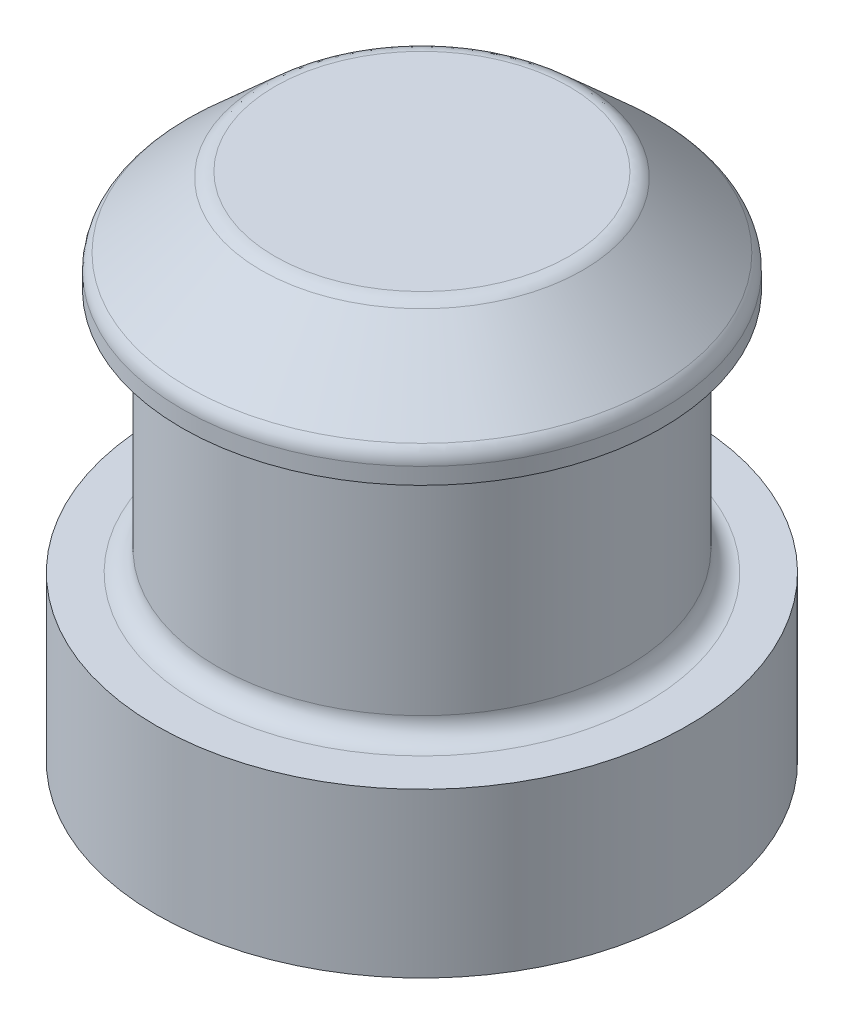
ISO-10303-21;
HEADER;
FILE_DESCRIPTION(('STEP AP214'),'2;1');
FILE_NAME('part.step','',(''),(''),'','','');
FILE_SCHEMA(('AUTOMOTIVE_DESIGN { 1 0 10303 214 1 1 1 1 }'));
ENDSEC;
DATA;
#1=APPLICATION_CONTEXT('core data for automotive mechanical design processes');
#2=APPLICATION_PROTOCOL_DEFINITION('international standard','automotive_design',2000,#1);
#3=PRODUCT_CONTEXT('',#1,'mechanical');
#4=PRODUCT('Part','Part','',(#3));
#5=PRODUCT_RELATED_PRODUCT_CATEGORY('part','',(#4));
#6=PRODUCT_DEFINITION_FORMATION('','',#4);
#7=PRODUCT_DEFINITION_CONTEXT('part definition',#1,'design');
#8=PRODUCT_DEFINITION('design','',#6,#7);
#9=PRODUCT_DEFINITION_SHAPE('','',#8);
#10=(LENGTH_UNIT() NAMED_UNIT(*) SI_UNIT(.MILLI.,.METRE.));
#11=(NAMED_UNIT(*) PLANE_ANGLE_UNIT() SI_UNIT($,.RADIAN.));
#12=(NAMED_UNIT(*) SI_UNIT($,.STERADIAN.) SOLID_ANGLE_UNIT());
#13=UNCERTAINTY_MEASURE_WITH_UNIT(LENGTH_MEASURE(1.E-05),#10,'distance_accuracy_value','');
#14=(GEOMETRIC_REPRESENTATION_CONTEXT(3) GLOBAL_UNCERTAINTY_ASSIGNED_CONTEXT((#13)) GLOBAL_UNIT_ASSIGNED_CONTEXT((#10,
#11,#12)) REPRESENTATION_CONTEXT('',''));
#15=CARTESIAN_POINT('',(0.,0.,0.));
#16=DIRECTION('',(0.,0.,1.));
#17=DIRECTION('',(1.,0.,0.));
#18=AXIS2_PLACEMENT_3D('',#15,#16,#17);
#19=CARTESIAN_POINT('',(0.,1.51003988104463,0.));
#20=DIRECTION('',(0.,-1.,0.));
#21=DIRECTION('',(0.,0.,-1.));
#22=AXIS2_PLACEMENT_3D('',#19,#20,#21);
#23=CYLINDRICAL_SURFACE('',#22,2.99);
#24=CARTESIAN_POINT('',(0.,1.51003988104463,0.));
#25=DIRECTION('',(0.,1.,0.));
#26=DIRECTION('',(0.,0.,1.));
#27=AXIS2_PLACEMENT_3D('',#24,#25,#26);
#28=CIRCLE('',#27,2.99);
#29=CARTESIAN_POINT('',(0.,1.51003988104463,2.99));
#30=VERTEX_POINT('',#29);
#31=EDGE_CURVE('E69',#30,#30,#28,.T.);
#32=ORIENTED_EDGE('',*,*,#31,.F.);
#33=EDGE_LOOP('',(#32));
#34=FACE_BOUND('',#33,.T.);
#35=CARTESIAN_POINT('',(0.,-0.329960118955374,0.));
#36=DIRECTION('',(0.,1.,0.));
#37=DIRECTION('',(0.,0.,1.));
#38=AXIS2_PLACEMENT_3D('',#35,#36,#37);
#39=CIRCLE('',#38,2.99);
#40=CARTESIAN_POINT('',(0.,-0.329960118955374,2.99));
#41=VERTEX_POINT('',#40);
#42=EDGE_CURVE('E70',#41,#41,#39,.T.);
#43=ORIENTED_EDGE('',*,*,#42,.T.);
#44=EDGE_LOOP('',(#43));
#45=FACE_BOUND('',#44,.T.);
#46=ADVANCED_FACE('F37',(#34,#45),#23,.T.);
#47=CARTESIAN_POINT('',(0.,1.51003988104463,0.));
#48=DIRECTION('',(0.,1.,0.));
#49=DIRECTION('',(0.,0.,1.));
#50=AXIS2_PLACEMENT_3D('',#47,#48,#49);
#51=PLANE('',#50);
#52=CARTESIAN_POINT('',(0.,1.51003988104463,0.));
#53=DIRECTION('',(0.,1.,0.));
#54=DIRECTION('',(0.,0.,1.));
#55=AXIS2_PLACEMENT_3D('',#52,#53,#54);
#56=CIRCLE('',#55,2.53);
#57=CARTESIAN_POINT('',(0.,1.51003988104463,2.53));
#58=VERTEX_POINT('',#57);
#59=EDGE_CURVE('E10',#58,#58,#56,.F.);
#60=ORIENTED_EDGE('',*,*,#59,.T.);
#61=EDGE_LOOP('',(#60));
#62=FACE_BOUND('',#61,.T.);
#63=ORIENTED_EDGE('',*,*,#31,.T.);
#64=EDGE_LOOP('',(#63));
#65=FACE_BOUND('',#64,.T.);
#66=ADVANCED_FACE('F105',(#62,#65),#51,.T.);
#67=CARTESIAN_POINT('',(0.,-0.329960118955374,0.));
#68=DIRECTION('',(0.,1.,0.));
#69=DIRECTION('',(0.,0.,1.));
#70=AXIS2_PLACEMENT_3D('',#67,#68,#69);
#71=PLANE('',#70);
#72=ORIENTED_EDGE('',*,*,#42,.F.);
#73=EDGE_LOOP('',(#72));
#74=FACE_BOUND('',#73,.T.);
#75=ADVANCED_FACE('F111',(#74),#71,.F.);
#76=CARTESIAN_POINT('',(0.,4.27003988104463,0.));
#77=DIRECTION('',(0.,-1.,0.));
#78=DIRECTION('',(0.,0.,-1.));
#79=AXIS2_PLACEMENT_3D('',#76,#77,#78);
#80=CYLINDRICAL_SURFACE('',#79,2.3);
#81=CARTESIAN_POINT('',(0.,1.74003988104463,0.));
#82=DIRECTION('',(0.,1.,0.));
#83=DIRECTION('',(0.,0.,1.));
#84=AXIS2_PLACEMENT_3D('',#81,#82,#83);
#85=CIRCLE('',#84,2.3);
#86=CARTESIAN_POINT('',(0.,1.74003988104463,2.3));
#87=VERTEX_POINT('',#86);
#88=EDGE_CURVE('E45',#87,#87,#85,.T.);
#89=ORIENTED_EDGE('',*,*,#88,.T.);
#90=EDGE_LOOP('',(#89));
#91=FACE_BOUND('',#90,.T.);
#92=CARTESIAN_POINT('',(0.,4.27003988104463,0.));
#93=DIRECTION('',(0.,1.,0.));
#94=DIRECTION('',(0.,0.,1.));
#95=AXIS2_PLACEMENT_3D('',#92,#93,#94);
#96=CIRCLE('',#95,2.3);
#97=CARTESIAN_POINT('',(0.,4.27003988104463,2.3));
#98=VERTEX_POINT('',#97);
#99=EDGE_CURVE('E74',#98,#98,#96,.T.);
#100=ORIENTED_EDGE('',*,*,#99,.F.);
#101=EDGE_LOOP('',(#100));
#102=FACE_BOUND('',#101,.T.);
#103=ADVANCED_FACE('F131',(#91,#102),#80,.T.);
#104=CARTESIAN_POINT('',(0.,5.42003988104463,0.));
#105=DIRECTION('',(0.,-1.,0.));
#106=DIRECTION('',(0.,0.,-1.));
#107=AXIS2_PLACEMENT_3D('',#104,#105,#106);
#108=CYLINDRICAL_SURFACE('',#107,2.7025);
#109=CARTESIAN_POINT('',(0.,4.45513728342366,0.));
#110=DIRECTION('',(0.,1.,0.));
#111=DIRECTION('',(0.,0.,1.));
#112=AXIS2_PLACEMENT_3D('',#109,#110,#111);
#113=CIRCLE('',#112,2.7025);
#114=CARTESIAN_POINT('',(0.,4.45513728342366,2.7025));
#115=VERTEX_POINT('',#114);
#116=EDGE_CURVE('E50',#115,#115,#113,.F.);
#117=ORIENTED_EDGE('',*,*,#116,.T.);
#118=EDGE_LOOP('',(#117));
#119=FACE_BOUND('',#118,.T.);
#120=CARTESIAN_POINT('',(0.,4.27003988104463,0.));
#121=DIRECTION('',(0.,1.,0.));
#122=DIRECTION('',(0.,0.,1.));
#123=AXIS2_PLACEMENT_3D('',#120,#121,#122);
#124=CIRCLE('',#123,2.7025);
#125=CARTESIAN_POINT('',(0.,4.27003988104463,2.7025));
#126=VERTEX_POINT('',#125);
#127=EDGE_CURVE('E81',#126,#126,#124,.T.);
#128=ORIENTED_EDGE('',*,*,#127,.T.);
#129=EDGE_LOOP('',(#128));
#130=FACE_BOUND('',#129,.T.);
#131=ADVANCED_FACE('F86',(#119,#130),#108,.T.);
#132=CARTESIAN_POINT('',(0.,5.42003988104463,0.));
#133=DIRECTION('',(0.,1.,0.));
#134=DIRECTION('',(0.,0.,1.));
#135=AXIS2_PLACEMENT_3D('',#132,#133,#134);
#136=PLANE('',#135);
#137=CARTESIAN_POINT('',(0.,5.42003988104463,0.));
#138=DIRECTION('',(0.,1.,0.));
#139=DIRECTION('',(0.,0.,1.));
#140=AXIS2_PLACEMENT_3D('',#137,#138,#139);
#141=CIRCLE('',#140,1.65630797790167);
#142=CARTESIAN_POINT('',(0.,5.42003988104463,1.65630797790167));
#143=VERTEX_POINT('',#142);
#144=EDGE_CURVE('E65',#143,#143,#141,.T.);
#145=ORIENTED_EDGE('',*,*,#144,.T.);
#146=EDGE_LOOP('',(#145));
#147=FACE_BOUND('',#146,.T.);
#148=ADVANCED_FACE('F91',(#147),#136,.T.);
#149=CARTESIAN_POINT('',(0.,4.27003988104463,0.));
#150=DIRECTION('',(0.,1.,0.));
#151=DIRECTION('',(0.,0.,1.));
#152=AXIS2_PLACEMENT_3D('',#149,#150,#151);
#153=PLANE('',#152);
#154=ORIENTED_EDGE('',*,*,#99,.T.);
#155=EDGE_LOOP('',(#154));
#156=FACE_BOUND('',#155,.T.);
#157=ORIENTED_EDGE('',*,*,#127,.F.);
#158=EDGE_LOOP('',(#157));
#159=FACE_BOUND('',#158,.T.);
#160=ADVANCED_FACE('F88',(#156,#159),#153,.F.);
#161=CARTESIAN_POINT('',(0.,5.42003988104463,0.));
#162=DIRECTION('',(0.,-1.,0.));
#163=DIRECTION('',(0.,0.,-1.));
#164=AXIS2_PLACEMENT_3D('',#161,#162,#163);
#165=CONICAL_SURFACE('',#164,1.74459670595982,0.837758040957277);
#166=CARTESIAN_POINT('',(0.,5.36096319090443,0.));
#167=DIRECTION('',(0.,1.,0.));
#168=DIRECTION('',(0.,0.,1.));
#169=AXIS2_PLACEMENT_3D('',#166,#167,#168);
#170=CIRCLE('',#169,1.81020801736421);
#171=CARTESIAN_POINT('',(0.,5.36096319090443,1.81020801736421));
#172=VERTEX_POINT('',#171);
#173=EDGE_CURVE('E55',#172,#172,#170,.F.);
#174=ORIENTED_EDGE('',*,*,#173,.T.);
#175=EDGE_LOOP('',(#174));
#176=FACE_BOUND('',#175,.T.);
#177=CARTESIAN_POINT('',(0.,4.62606059328346,0.));
#178=DIRECTION('',(0.,-1.,0.));
#179=DIRECTION('',(0.,0.,-1.));
#180=AXIS2_PLACEMENT_3D('',#177,#178,#179);
#181=CIRCLE('',#180,2.62640003946254);
#182=CARTESIAN_POINT('',(0.,4.62606059328346,-2.62640003946254));
#183=VERTEX_POINT('',#182);
#184=EDGE_CURVE('E61',#183,#183,#181,.F.);
#185=ORIENTED_EDGE('',*,*,#184,.T.);
#186=EDGE_LOOP('',(#185));
#187=FACE_BOUND('',#186,.T.);
#188=ADVANCED_FACE('F90',(#176,#187),#165,.T.);
#189=CARTESIAN_POINT('',(0.,5.19003988104463,0.));
#190=DIRECTION('',(0.,1.,0.));
#191=DIRECTION('',(0.,0.,1.));
#192=AXIS2_PLACEMENT_3D('',#189,#190,#191);
#193=TOROIDAL_SURFACE('',#192,1.65630797790167,0.23);
#194=ORIENTED_EDGE('',*,*,#173,.F.);
#195=EDGE_LOOP('',(#194));
#196=FACE_BOUND('',#195,.T.);
#197=ORIENTED_EDGE('',*,*,#144,.F.);
#198=EDGE_LOOP('',(#197));
#199=FACE_BOUND('',#198,.T.);
#200=ADVANCED_FACE('F98',(#196,#199),#193,.T.);
#201=CARTESIAN_POINT('',(0.,4.45513728342366,0.));
#202=DIRECTION('',(0.,1.,0.));
#203=DIRECTION('',(0.,0.,1.));
#204=AXIS2_PLACEMENT_3D('',#201,#202,#203);
#205=TOROIDAL_SURFACE('',#204,2.4725,0.23);
#206=ORIENTED_EDGE('',*,*,#184,.F.);
#207=EDGE_LOOP('',(#206));
#208=FACE_BOUND('',#207,.T.);
#209=ORIENTED_EDGE('',*,*,#116,.F.);
#210=EDGE_LOOP('',(#209));
#211=FACE_BOUND('',#210,.T.);
#212=ADVANCED_FACE('F118',(#208,#211),#205,.T.);
#213=CARTESIAN_POINT('',(0.,1.74003988104463,0.));
#214=DIRECTION('',(0.,1.,0.));
#215=DIRECTION('',(0.,0.,1.));
#216=AXIS2_PLACEMENT_3D('',#213,#214,#215);
#217=TOROIDAL_SURFACE('',#216,2.53,0.23);
#218=ORIENTED_EDGE('',*,*,#59,.F.);
#219=EDGE_LOOP('',(#218));
#220=FACE_BOUND('',#219,.T.);
#221=ORIENTED_EDGE('',*,*,#88,.F.);
#222=EDGE_LOOP('',(#221));
#223=FACE_BOUND('',#222,.T.);
#224=ADVANCED_FACE('F39',(#220,#223),#217,.F.);
#225=CLOSED_SHELL('',(#46,#66,#75,#103,#131,#148,#160,#188,#200,#212,#224));
#226=MANIFOLD_SOLID_BREP('B2',#225);
#227=ADVANCED_BREP_SHAPE_REPRESENTATION('',(#18,#226),#14);
#228=SHAPE_DEFINITION_REPRESENTATION(#9,#227);
ENDSEC;
END-ISO-10303-21;
